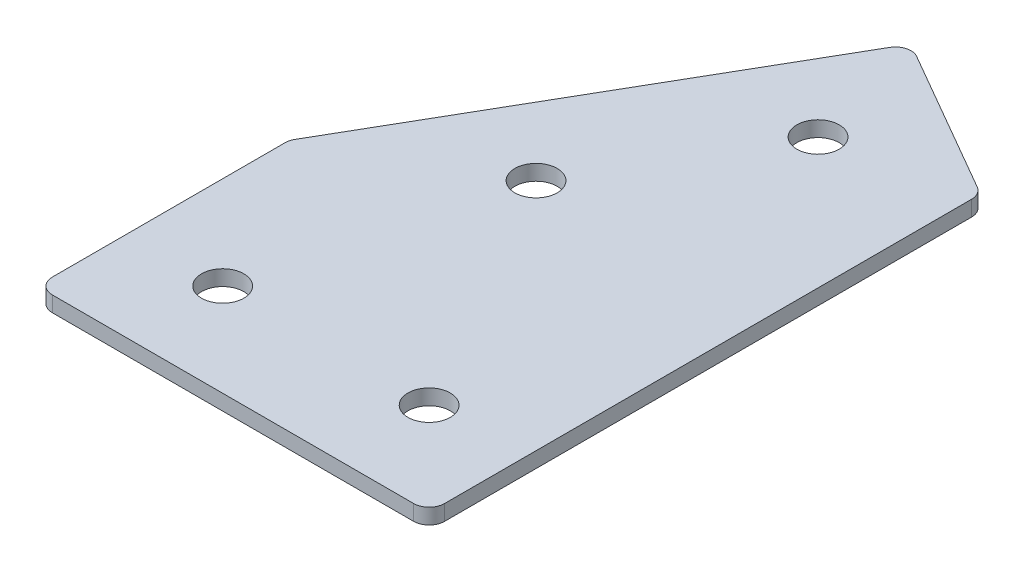
ISO-10303-21;
HEADER;
FILE_DESCRIPTION(('STEP AP214'),'2;1');
FILE_NAME('part.step','',(''),(''),'','','');
FILE_SCHEMA(('AUTOMOTIVE_DESIGN { 1 0 10303 214 1 1 1 1 }'));
ENDSEC;
DATA;
#1=APPLICATION_CONTEXT('core data for automotive mechanical design processes');
#2=APPLICATION_PROTOCOL_DEFINITION('international standard','automotive_design',2000,#1);
#3=PRODUCT_CONTEXT('',#1,'mechanical');
#4=PRODUCT('Part','Part','',(#3));
#5=PRODUCT_RELATED_PRODUCT_CATEGORY('part','',(#4));
#6=PRODUCT_DEFINITION_FORMATION('','',#4);
#7=PRODUCT_DEFINITION_CONTEXT('part definition',#1,'design');
#8=PRODUCT_DEFINITION('design','',#6,#7);
#9=PRODUCT_DEFINITION_SHAPE('','',#8);
#10=(LENGTH_UNIT() NAMED_UNIT(*) SI_UNIT(.MILLI.,.METRE.));
#11=(NAMED_UNIT(*) PLANE_ANGLE_UNIT() SI_UNIT($,.RADIAN.));
#12=(NAMED_UNIT(*) SI_UNIT($,.STERADIAN.) SOLID_ANGLE_UNIT());
#13=UNCERTAINTY_MEASURE_WITH_UNIT(LENGTH_MEASURE(1.E-05),#10,'distance_accuracy_value','');
#14=(GEOMETRIC_REPRESENTATION_CONTEXT(3) GLOBAL_UNCERTAINTY_ASSIGNED_CONTEXT((#13)) GLOBAL_UNIT_ASSIGNED_CONTEXT((#10,
#11,#12)) REPRESENTATION_CONTEXT('',''));
#15=CARTESIAN_POINT('',(0.,0.,0.));
#16=DIRECTION('',(0.,0.,1.));
#17=DIRECTION('',(1.,0.,0.));
#18=AXIS2_PLACEMENT_3D('',#15,#16,#17);
#19=CARTESIAN_POINT('',(0.,0.,0.));
#20=DIRECTION('',(0.,1.,0.));
#21=DIRECTION('',(0.,0.,1.));
#22=AXIS2_PLACEMENT_3D('',#19,#20,#21);
#23=PLANE('',#22);
#24=CARTESIAN_POINT('',(80.,0.,0.));
#25=DIRECTION('',(0.,1.,0.));
#26=DIRECTION('',(0.,0.,1.));
#27=AXIS2_PLACEMENT_3D('',#24,#25,#26);
#28=CIRCLE('',#27,4.09999999999999);
#29=CARTESIAN_POINT('',(80.,0.,4.09999999999999));
#30=VERTEX_POINT('',#29);
#31=EDGE_CURVE('E201',#30,#30,#28,.T.);
#32=ORIENTED_EDGE('',*,*,#31,.T.);
#33=EDGE_LOOP('',(#32));
#34=FACE_BOUND('',#33,.T.);
#35=CARTESIAN_POINT('',(72.6794919243111,0.,-82.6794919243113));
#36=DIRECTION('',(0.,1.,0.));
#37=DIRECTION('',(0.,0.,1.));
#38=AXIS2_PLACEMENT_3D('',#35,#36,#37);
#39=CIRCLE('',#38,4.09999999999997);
#40=CARTESIAN_POINT('',(72.6794919243111,0.,-78.5794919243114));
#41=VERTEX_POINT('',#40);
#42=EDGE_CURVE('E195',#41,#41,#39,.T.);
#43=ORIENTED_EDGE('',*,*,#42,.T.);
#44=EDGE_LOOP('',(#43));
#45=FACE_BOUND('',#44,.T.);
#46=CARTESIAN_POINT('',(52.6794919243111,0.,-48.0384757729338));
#47=DIRECTION('',(0.,1.,0.));
#48=DIRECTION('',(0.,0.,1.));
#49=AXIS2_PLACEMENT_3D('',#46,#47,#48);
#50=CIRCLE('',#49,4.1);
#51=CARTESIAN_POINT('',(52.6794919243111,0.,-43.9384757729338));
#52=VERTEX_POINT('',#51);
#53=EDGE_CURVE('E189',#52,#52,#50,.T.);
#54=ORIENTED_EDGE('',*,*,#53,.T.);
#55=EDGE_LOOP('',(#54));
#56=FACE_BOUND('',#55,.T.);
#57=CARTESIAN_POINT('',(40.,0.,0.));
#58=DIRECTION('',(0.,1.,0.));
#59=DIRECTION('',(0.,0.,1.));
#60=AXIS2_PLACEMENT_3D('',#57,#58,#59);
#61=CIRCLE('',#60,4.1);
#62=CARTESIAN_POINT('',(40.,0.,4.10000000000001));
#63=VERTEX_POINT('',#62);
#64=EDGE_CURVE('E115',#63,#63,#61,.T.);
#65=ORIENTED_EDGE('',*,*,#64,.T.);
#66=EDGE_LOOP('',(#65));
#67=FACE_BOUND('',#66,.T.);
#68=DIRECTION('',(0.,0.,1.));
#69=VECTOR('',#68,1.);
#70=CARTESIAN_POINT('',(22.,0.,-30.9000370096279));
#71=LINE('',#70,#69);
#72=CARTESIAN_POINT('',(22.,0.,-30.0961894323345));
#73=VERTEX_POINT('',#72);
#74=CARTESIAN_POINT('',(22.,0.,15.));
#75=VERTEX_POINT('',#74);
#76=EDGE_CURVE('E182',#73,#75,#71,.T.);
#77=ORIENTED_EDGE('',*,*,#76,.F.);
#78=CARTESIAN_POINT('',(25.,0.,-30.0961894323345));
#79=DIRECTION('',(0.,1.,0.));
#80=DIRECTION('',(0.,0.,1.));
#81=AXIS2_PLACEMENT_3D('',#78,#79,#80);
#82=CIRCLE('',#81,3.);
#83=CARTESIAN_POINT('',(22.4019237886466,0.,-31.5961894323345));
#84=VERTEX_POINT('',#83);
#85=EDGE_CURVE('E146',#73,#84,#82,.F.);
#86=ORIENTED_EDGE('',*,*,#85,.T.);
#87=DIRECTION('',(-0.5,0.,0.866025403784439));
#88=VECTOR('',#87,1.);
#89=CARTESIAN_POINT('',(66.0910346561912,0.,-107.267949192431));
#90=LINE('',#89,#88);
#91=CARTESIAN_POINT('',(64.5910346561912,0.,-104.669872981078));
#92=VERTEX_POINT('',#91);
#93=EDGE_CURVE('E174',#92,#84,#90,.T.);
#94=ORIENTED_EDGE('',*,*,#93,.F.);
#95=CARTESIAN_POINT('',(67.1891108675445,0.,-103.169872981078));
#96=DIRECTION('',(0.,1.,0.));
#97=DIRECTION('',(0.,0.,1.));
#98=AXIS2_PLACEMENT_3D('',#95,#96,#97);
#99=CIRCLE('',#98,3.);
#100=CARTESIAN_POINT('',(68.6891108675445,0.,-105.767949192431));
#101=VERTEX_POINT('',#100);
#102=EDGE_CURVE('E118',#92,#101,#99,.F.);
#103=ORIENTED_EDGE('',*,*,#102,.T.);
#104=DIRECTION('',(-0.866025403784439,0.,-0.499999999999999));
#105=VECTOR('',#104,1.);
#106=CARTESIAN_POINT('',(98.,0.,-88.8452994616208));
#107=LINE('',#106,#105);
#108=CARTESIAN_POINT('',(96.5,0.,-89.7113248654052));
#109=VERTEX_POINT('',#108);
#110=EDGE_CURVE('E119',#109,#101,#107,.T.);
#111=ORIENTED_EDGE('',*,*,#110,.F.);
#112=CARTESIAN_POINT('',(95.,0.,-87.1132486540519));
#113=DIRECTION('',(0.,1.,0.));
#114=DIRECTION('',(0.,0.,1.));
#115=AXIS2_PLACEMENT_3D('',#112,#113,#114);
#116=CIRCLE('',#115,3.);
#117=CARTESIAN_POINT('',(98.,0.,-87.1132486540519));
#118=VERTEX_POINT('',#117);
#119=EDGE_CURVE('E141',#109,#118,#116,.F.);
#120=ORIENTED_EDGE('',*,*,#119,.T.);
#121=DIRECTION('',(0.,0.,-1.));
#122=VECTOR('',#121,1.);
#123=CARTESIAN_POINT('',(98.,0.,18.));
#124=LINE('',#123,#122);
#125=CARTESIAN_POINT('',(98.,0.,15.));
#126=VERTEX_POINT('',#125);
#127=EDGE_CURVE('E123',#126,#118,#124,.T.);
#128=ORIENTED_EDGE('',*,*,#127,.F.);
#129=CARTESIAN_POINT('',(95.,0.,15.));
#130=DIRECTION('',(0.,1.,0.));
#131=DIRECTION('',(0.,0.,1.));
#132=AXIS2_PLACEMENT_3D('',#129,#130,#131);
#133=CIRCLE('',#132,3.);
#134=CARTESIAN_POINT('',(94.9999999999999,0.,18.));
#135=VERTEX_POINT('',#134);
#136=EDGE_CURVE('E31',#126,#135,#133,.F.);
#137=ORIENTED_EDGE('',*,*,#136,.T.);
#138=DIRECTION('',(1.,0.,0.));
#139=VECTOR('',#138,1.);
#140=CARTESIAN_POINT('',(22.,0.,18.));
#141=LINE('',#140,#139);
#142=CARTESIAN_POINT('',(25.,0.,18.));
#143=VERTEX_POINT('',#142);
#144=EDGE_CURVE('E180',#143,#135,#141,.T.);
#145=ORIENTED_EDGE('',*,*,#144,.F.);
#146=CARTESIAN_POINT('',(25.,0.,15.));
#147=DIRECTION('',(0.,1.,0.));
#148=DIRECTION('',(0.,0.,1.));
#149=AXIS2_PLACEMENT_3D('',#146,#147,#148);
#150=CIRCLE('',#149,3.);
#151=EDGE_CURVE('E144',#143,#75,#150,.F.);
#152=ORIENTED_EDGE('',*,*,#151,.T.);
#153=EDGE_LOOP('',(#77,#86,#94,#103,#111,#120,#128,#137,#145,#152));
#154=FACE_BOUND('',#153,.T.);
#155=ADVANCED_FACE('F16',(#34,#45,#56,#67,#154),#23,.F.);
#156=CARTESIAN_POINT('',(66.0910346561912,0.,-107.267949192431));
#157=DIRECTION('',(-0.866025403784439,0.,-0.5));
#158=DIRECTION('',(-0.5,0.,0.866025403784439));
#159=AXIS2_PLACEMENT_3D('',#156,#157,#158);
#160=PLANE('',#159);
#161=ORIENTED_EDGE('',*,*,#93,.T.);
#162=DIRECTION('',(0.,1.,0.));
#163=VECTOR('',#162,1.);
#164=CARTESIAN_POINT('',(22.4019237886466,0.,-31.5961894323345));
#165=LINE('',#164,#163);
#166=CARTESIAN_POINT('',(22.4019237886466,3.,-31.5961894323345));
#167=VERTEX_POINT('',#166);
#168=EDGE_CURVE('E105',#84,#167,#165,.T.);
#169=ORIENTED_EDGE('',*,*,#168,.T.);
#170=DIRECTION('',(-0.5,0.,0.866025403784439));
#171=VECTOR('',#170,1.);
#172=CARTESIAN_POINT('',(66.0910346561912,3.,-107.267949192431));
#173=LINE('',#172,#171);
#174=CARTESIAN_POINT('',(64.5910346561912,3.,-104.669872981078));
#175=VERTEX_POINT('',#174);
#176=EDGE_CURVE('E97',#175,#167,#173,.T.);
#177=ORIENTED_EDGE('',*,*,#176,.F.);
#178=DIRECTION('',(0.,1.,0.));
#179=VECTOR('',#178,1.);
#180=CARTESIAN_POINT('',(64.5910346561912,0.,-104.669872981078));
#181=LINE('',#180,#179);
#182=EDGE_CURVE('E111',#175,#92,#181,.F.);
#183=ORIENTED_EDGE('',*,*,#182,.T.);
#184=EDGE_LOOP('',(#161,#169,#177,#183));
#185=FACE_BOUND('',#184,.T.);
#186=ADVANCED_FACE('F110',(#185),#160,.T.);
#187=CARTESIAN_POINT('',(98.,0.,-88.8452994616208));
#188=DIRECTION('',(0.499999999999999,0.,-0.866025403784439));
#189=DIRECTION('',(-0.866025403784439,0.,-0.499999999999999));
#190=AXIS2_PLACEMENT_3D('',#187,#188,#189);
#191=PLANE('',#190);
#192=DIRECTION('',(-0.866025403784439,0.,-0.499999999999999));
#193=VECTOR('',#192,1.);
#194=CARTESIAN_POINT('',(98.,3.,-88.8452994616208));
#195=LINE('',#194,#193);
#196=CARTESIAN_POINT('',(96.5,3.,-89.7113248654052));
#197=VERTEX_POINT('',#196);
#198=CARTESIAN_POINT('',(68.6891108675445,3.,-105.767949192431));
#199=VERTEX_POINT('',#198);
#200=EDGE_CURVE('E99',#197,#199,#195,.T.);
#201=ORIENTED_EDGE('',*,*,#200,.F.);
#202=DIRECTION('',(0.,1.,0.));
#203=VECTOR('',#202,1.);
#204=CARTESIAN_POINT('',(96.5,0.,-89.7113248654052));
#205=LINE('',#204,#203);
#206=EDGE_CURVE('E10',#197,#109,#205,.F.);
#207=ORIENTED_EDGE('',*,*,#206,.T.);
#208=ORIENTED_EDGE('',*,*,#110,.T.);
#209=DIRECTION('',(0.,1.,0.));
#210=VECTOR('',#209,1.);
#211=CARTESIAN_POINT('',(68.6891108675445,0.,-105.767949192431));
#212=LINE('',#211,#210);
#213=EDGE_CURVE('E24',#101,#199,#212,.T.);
#214=ORIENTED_EDGE('',*,*,#213,.T.);
#215=EDGE_LOOP('',(#201,#207,#208,#214));
#216=FACE_BOUND('',#215,.T.);
#217=ADVANCED_FACE('F157',(#216),#191,.T.);
#218=CARTESIAN_POINT('',(98.,0.,18.));
#219=DIRECTION('',(1.,0.,0.));
#220=DIRECTION('',(0.,0.,-1.));
#221=AXIS2_PLACEMENT_3D('',#218,#219,#220);
#222=PLANE('',#221);
#223=DIRECTION('',(0.,0.,-1.));
#224=VECTOR('',#223,1.);
#225=CARTESIAN_POINT('',(98.,3.,18.));
#226=LINE('',#225,#224);
#227=CARTESIAN_POINT('',(98.,3.,15.));
#228=VERTEX_POINT('',#227);
#229=CARTESIAN_POINT('',(98.,3.,-87.1132486540519));
#230=VERTEX_POINT('',#229);
#231=EDGE_CURVE('E170',#228,#230,#226,.T.);
#232=ORIENTED_EDGE('',*,*,#231,.F.);
#233=DIRECTION('',(0.,1.,0.));
#234=VECTOR('',#233,1.);
#235=CARTESIAN_POINT('',(98.,0.,15.));
#236=LINE('',#235,#234);
#237=EDGE_CURVE('E155',#228,#126,#236,.F.);
#238=ORIENTED_EDGE('',*,*,#237,.T.);
#239=ORIENTED_EDGE('',*,*,#127,.T.);
#240=DIRECTION('',(0.,1.,0.));
#241=VECTOR('',#240,1.);
#242=CARTESIAN_POINT('',(98.,0.,-87.1132486540519));
#243=LINE('',#242,#241);
#244=EDGE_CURVE('E152',#118,#230,#243,.T.);
#245=ORIENTED_EDGE('',*,*,#244,.T.);
#246=EDGE_LOOP('',(#232,#238,#239,#245));
#247=FACE_BOUND('',#246,.T.);
#248=ADVANCED_FACE('F169',(#247),#222,.T.);
#249=CARTESIAN_POINT('',(22.,0.,18.));
#250=DIRECTION('',(0.,0.,1.));
#251=DIRECTION('',(1.,0.,0.));
#252=AXIS2_PLACEMENT_3D('',#249,#250,#251);
#253=PLANE('',#252);
#254=DIRECTION('',(1.,0.,0.));
#255=VECTOR('',#254,1.);
#256=CARTESIAN_POINT('',(22.,3.,18.));
#257=LINE('',#256,#255);
#258=CARTESIAN_POINT('',(25.,3.,18.));
#259=VERTEX_POINT('',#258);
#260=CARTESIAN_POINT('',(94.9999999999999,3.,18.));
#261=VERTEX_POINT('',#260);
#262=EDGE_CURVE('E173',#259,#261,#257,.T.);
#263=ORIENTED_EDGE('',*,*,#262,.F.);
#264=DIRECTION('',(0.,1.,0.));
#265=VECTOR('',#264,1.);
#266=CARTESIAN_POINT('',(25.,0.,18.));
#267=LINE('',#266,#265);
#268=EDGE_CURVE('E38',#259,#143,#267,.F.);
#269=ORIENTED_EDGE('',*,*,#268,.T.);
#270=ORIENTED_EDGE('',*,*,#144,.T.);
#271=DIRECTION('',(0.,1.,0.));
#272=VECTOR('',#271,1.);
#273=CARTESIAN_POINT('',(95.,0.,18.));
#274=LINE('',#273,#272);
#275=EDGE_CURVE('E148',#135,#261,#274,.T.);
#276=ORIENTED_EDGE('',*,*,#275,.T.);
#277=EDGE_LOOP('',(#263,#269,#270,#276));
#278=FACE_BOUND('',#277,.T.);
#279=ADVANCED_FACE('F337',(#278),#253,.T.);
#280=CARTESIAN_POINT('',(22.,0.,-30.9000370096279));
#281=DIRECTION('',(-1.,0.,0.));
#282=DIRECTION('',(0.,0.,1.));
#283=AXIS2_PLACEMENT_3D('',#280,#281,#282);
#284=PLANE('',#283);
#285=DIRECTION('',(0.,0.,1.));
#286=VECTOR('',#285,1.);
#287=CARTESIAN_POINT('',(22.,3.,-30.9000370096279));
#288=LINE('',#287,#286);
#289=CARTESIAN_POINT('',(22.,3.,-30.0961894323345));
#290=VERTEX_POINT('',#289);
#291=CARTESIAN_POINT('',(22.,3.,15.));
#292=VERTEX_POINT('',#291);
#293=EDGE_CURVE('E114',#290,#292,#288,.T.);
#294=ORIENTED_EDGE('',*,*,#293,.F.);
#295=DIRECTION('',(0.,1.,0.));
#296=VECTOR('',#295,1.);
#297=CARTESIAN_POINT('',(22.,0.,-30.0961894323345));
#298=LINE('',#297,#296);
#299=EDGE_CURVE('E138',#290,#73,#298,.F.);
#300=ORIENTED_EDGE('',*,*,#299,.T.);
#301=ORIENTED_EDGE('',*,*,#76,.T.);
#302=DIRECTION('',(0.,1.,0.));
#303=VECTOR('',#302,1.);
#304=CARTESIAN_POINT('',(22.,0.,15.));
#305=LINE('',#304,#303);
#306=EDGE_CURVE('E135',#75,#292,#305,.T.);
#307=ORIENTED_EDGE('',*,*,#306,.T.);
#308=EDGE_LOOP('',(#294,#300,#301,#307));
#309=FACE_BOUND('',#308,.T.);
#310=ADVANCED_FACE('F223',(#309),#284,.T.);
#311=CARTESIAN_POINT('',(0.,3.,0.));
#312=DIRECTION('',(0.,1.,0.));
#313=DIRECTION('',(0.,0.,1.));
#314=AXIS2_PLACEMENT_3D('',#311,#312,#313);
#315=PLANE('',#314);
#316=CARTESIAN_POINT('',(80.,3.,0.));
#317=DIRECTION('',(0.,1.,0.));
#318=DIRECTION('',(0.,0.,1.));
#319=AXIS2_PLACEMENT_3D('',#316,#317,#318);
#320=CIRCLE('',#319,4.09999999999999);
#321=CARTESIAN_POINT('',(80.,3.,4.09999999999999));
#322=VERTEX_POINT('',#321);
#323=EDGE_CURVE('E204',#322,#322,#320,.T.);
#324=ORIENTED_EDGE('',*,*,#323,.F.);
#325=EDGE_LOOP('',(#324));
#326=FACE_BOUND('',#325,.T.);
#327=CARTESIAN_POINT('',(72.6794919243111,3.,-82.6794919243113));
#328=DIRECTION('',(0.,1.,0.));
#329=DIRECTION('',(0.,0.,1.));
#330=AXIS2_PLACEMENT_3D('',#327,#328,#329);
#331=CIRCLE('',#330,4.09999999999997);
#332=CARTESIAN_POINT('',(72.6794919243111,3.,-78.5794919243114));
#333=VERTEX_POINT('',#332);
#334=EDGE_CURVE('E198',#333,#333,#331,.T.);
#335=ORIENTED_EDGE('',*,*,#334,.F.);
#336=EDGE_LOOP('',(#335));
#337=FACE_BOUND('',#336,.T.);
#338=CARTESIAN_POINT('',(52.6794919243111,3.,-48.0384757729338));
#339=DIRECTION('',(0.,1.,0.));
#340=DIRECTION('',(0.,0.,1.));
#341=AXIS2_PLACEMENT_3D('',#338,#339,#340);
#342=CIRCLE('',#341,4.1);
#343=CARTESIAN_POINT('',(52.6794919243111,3.,-43.9384757729338));
#344=VERTEX_POINT('',#343);
#345=EDGE_CURVE('E192',#344,#344,#342,.T.);
#346=ORIENTED_EDGE('',*,*,#345,.F.);
#347=EDGE_LOOP('',(#346));
#348=FACE_BOUND('',#347,.T.);
#349=CARTESIAN_POINT('',(40.,3.,0.));
#350=DIRECTION('',(0.,1.,0.));
#351=DIRECTION('',(0.,0.,1.));
#352=AXIS2_PLACEMENT_3D('',#349,#350,#351);
#353=CIRCLE('',#352,4.1);
#354=CARTESIAN_POINT('',(40.,3.,4.10000000000001));
#355=VERTEX_POINT('',#354);
#356=EDGE_CURVE('E186',#355,#355,#353,.T.);
#357=ORIENTED_EDGE('',*,*,#356,.F.);
#358=EDGE_LOOP('',(#357));
#359=FACE_BOUND('',#358,.T.);
#360=ORIENTED_EDGE('',*,*,#176,.T.);
#361=CARTESIAN_POINT('',(25.,3.,-30.0961894323345));
#362=DIRECTION('',(0.,1.,0.));
#363=DIRECTION('',(0.,0.,1.));
#364=AXIS2_PLACEMENT_3D('',#361,#362,#363);
#365=CIRCLE('',#364,3.);
#366=EDGE_CURVE('E133',#167,#290,#365,.T.);
#367=ORIENTED_EDGE('',*,*,#366,.T.);
#368=ORIENTED_EDGE('',*,*,#293,.T.);
#369=CARTESIAN_POINT('',(25.,3.,15.));
#370=DIRECTION('',(0.,1.,0.));
#371=DIRECTION('',(0.,0.,1.));
#372=AXIS2_PLACEMENT_3D('',#369,#370,#371);
#373=CIRCLE('',#372,3.);
#374=EDGE_CURVE('E131',#292,#259,#373,.T.);
#375=ORIENTED_EDGE('',*,*,#374,.T.);
#376=ORIENTED_EDGE('',*,*,#262,.T.);
#377=CARTESIAN_POINT('',(95.,3.,15.));
#378=DIRECTION('',(0.,1.,0.));
#379=DIRECTION('',(0.,0.,1.));
#380=AXIS2_PLACEMENT_3D('',#377,#378,#379);
#381=CIRCLE('',#380,3.);
#382=EDGE_CURVE('E129',#261,#228,#381,.T.);
#383=ORIENTED_EDGE('',*,*,#382,.T.);
#384=ORIENTED_EDGE('',*,*,#231,.T.);
#385=CARTESIAN_POINT('',(95.,3.,-87.1132486540519));
#386=DIRECTION('',(0.,1.,0.));
#387=DIRECTION('',(0.,0.,1.));
#388=AXIS2_PLACEMENT_3D('',#385,#386,#387);
#389=CIRCLE('',#388,3.);
#390=EDGE_CURVE('E104',#230,#197,#389,.T.);
#391=ORIENTED_EDGE('',*,*,#390,.T.);
#392=ORIENTED_EDGE('',*,*,#200,.T.);
#393=CARTESIAN_POINT('',(67.1891108675445,3.,-103.169872981078));
#394=DIRECTION('',(0.,1.,0.));
#395=DIRECTION('',(0.,0.,1.));
#396=AXIS2_PLACEMENT_3D('',#393,#394,#395);
#397=CIRCLE('',#396,3.);
#398=EDGE_CURVE('E94',#199,#175,#397,.T.);
#399=ORIENTED_EDGE('',*,*,#398,.T.);
#400=EDGE_LOOP('',(#360,#367,#368,#375,#376,#383,#384,#391,#392,#399));
#401=FACE_BOUND('',#400,.T.);
#402=ADVANCED_FACE('F96',(#326,#337,#348,#359,#401),#315,.T.);
#403=CARTESIAN_POINT('',(40.,0.,0.));
#404=DIRECTION('',(0.,1.,0.));
#405=DIRECTION('',(0.,0.,1.));
#406=AXIS2_PLACEMENT_3D('',#403,#404,#405);
#407=CYLINDRICAL_SURFACE('',#406,4.1);
#408=ORIENTED_EDGE('',*,*,#64,.F.);
#409=EDGE_LOOP('',(#408));
#410=FACE_BOUND('',#409,.T.);
#411=ORIENTED_EDGE('',*,*,#356,.T.);
#412=EDGE_LOOP('',(#411));
#413=FACE_BOUND('',#412,.T.);
#414=ADVANCED_FACE('F222',(#410,#413),#407,.F.);
#415=CARTESIAN_POINT('',(52.6794919243111,0.,-48.0384757729338));
#416=DIRECTION('',(0.,1.,0.));
#417=DIRECTION('',(0.,0.,1.));
#418=AXIS2_PLACEMENT_3D('',#415,#416,#417);
#419=CYLINDRICAL_SURFACE('',#418,4.1);
#420=ORIENTED_EDGE('',*,*,#53,.F.);
#421=EDGE_LOOP('',(#420));
#422=FACE_BOUND('',#421,.T.);
#423=ORIENTED_EDGE('',*,*,#345,.T.);
#424=EDGE_LOOP('',(#423));
#425=FACE_BOUND('',#424,.T.);
#426=ADVANCED_FACE('F232',(#422,#425),#419,.F.);
#427=CARTESIAN_POINT('',(72.6794919243111,0.,-82.6794919243113));
#428=DIRECTION('',(0.,1.,0.));
#429=DIRECTION('',(0.,0.,1.));
#430=AXIS2_PLACEMENT_3D('',#427,#428,#429);
#431=CYLINDRICAL_SURFACE('',#430,4.09999999999997);
#432=ORIENTED_EDGE('',*,*,#42,.F.);
#433=EDGE_LOOP('',(#432));
#434=FACE_BOUND('',#433,.T.);
#435=ORIENTED_EDGE('',*,*,#334,.T.);
#436=EDGE_LOOP('',(#435));
#437=FACE_BOUND('',#436,.T.);
#438=ADVANCED_FACE('F216',(#434,#437),#431,.F.);
#439=CARTESIAN_POINT('',(80.,0.,0.));
#440=DIRECTION('',(0.,1.,0.));
#441=DIRECTION('',(0.,0.,1.));
#442=AXIS2_PLACEMENT_3D('',#439,#440,#441);
#443=CYLINDRICAL_SURFACE('',#442,4.09999999999999);
#444=ORIENTED_EDGE('',*,*,#31,.F.);
#445=EDGE_LOOP('',(#444));
#446=FACE_BOUND('',#445,.T.);
#447=ORIENTED_EDGE('',*,*,#323,.T.);
#448=EDGE_LOOP('',(#447));
#449=FACE_BOUND('',#448,.T.);
#450=ADVANCED_FACE('F212',(#446,#449),#443,.F.);
#451=CARTESIAN_POINT('',(25.,0.,-30.0961894323345));
#452=DIRECTION('',(0.,1.,0.));
#453=DIRECTION('',(0.,0.,1.));
#454=AXIS2_PLACEMENT_3D('',#451,#452,#453);
#455=CYLINDRICAL_SURFACE('',#454,3.);
#456=ORIENTED_EDGE('',*,*,#85,.F.);
#457=ORIENTED_EDGE('',*,*,#299,.F.);
#458=ORIENTED_EDGE('',*,*,#366,.F.);
#459=ORIENTED_EDGE('',*,*,#168,.F.);
#460=EDGE_LOOP('',(#456,#457,#458,#459));
#461=FACE_BOUND('',#460,.T.);
#462=ADVANCED_FACE('F215',(#461),#455,.T.);
#463=CARTESIAN_POINT('',(25.,0.,15.));
#464=DIRECTION('',(0.,1.,0.));
#465=DIRECTION('',(0.,0.,1.));
#466=AXIS2_PLACEMENT_3D('',#463,#464,#465);
#467=CYLINDRICAL_SURFACE('',#466,3.);
#468=ORIENTED_EDGE('',*,*,#151,.F.);
#469=ORIENTED_EDGE('',*,*,#268,.F.);
#470=ORIENTED_EDGE('',*,*,#374,.F.);
#471=ORIENTED_EDGE('',*,*,#306,.F.);
#472=EDGE_LOOP('',(#468,#469,#470,#471));
#473=FACE_BOUND('',#472,.T.);
#474=ADVANCED_FACE('F252',(#473),#467,.T.);
#475=CARTESIAN_POINT('',(95.,0.,15.));
#476=DIRECTION('',(0.,1.,0.));
#477=DIRECTION('',(0.,0.,1.));
#478=AXIS2_PLACEMENT_3D('',#475,#476,#477);
#479=CYLINDRICAL_SURFACE('',#478,3.);
#480=ORIENTED_EDGE('',*,*,#136,.F.);
#481=ORIENTED_EDGE('',*,*,#237,.F.);
#482=ORIENTED_EDGE('',*,*,#382,.F.);
#483=ORIENTED_EDGE('',*,*,#275,.F.);
#484=EDGE_LOOP('',(#480,#481,#482,#483));
#485=FACE_BOUND('',#484,.T.);
#486=ADVANCED_FACE('F256',(#485),#479,.T.);
#487=CARTESIAN_POINT('',(95.,0.,-87.1132486540519));
#488=DIRECTION('',(0.,1.,0.));
#489=DIRECTION('',(0.,0.,1.));
#490=AXIS2_PLACEMENT_3D('',#487,#488,#489);
#491=CYLINDRICAL_SURFACE('',#490,3.);
#492=ORIENTED_EDGE('',*,*,#119,.F.);
#493=ORIENTED_EDGE('',*,*,#206,.F.);
#494=ORIENTED_EDGE('',*,*,#390,.F.);
#495=ORIENTED_EDGE('',*,*,#244,.F.);
#496=EDGE_LOOP('',(#492,#493,#494,#495));
#497=FACE_BOUND('',#496,.T.);
#498=ADVANCED_FACE('F165',(#497),#491,.T.);
#499=CARTESIAN_POINT('',(67.1891108675445,0.,-103.169872981078));
#500=DIRECTION('',(0.,1.,0.));
#501=DIRECTION('',(0.,0.,1.));
#502=AXIS2_PLACEMENT_3D('',#499,#500,#501);
#503=CYLINDRICAL_SURFACE('',#502,3.);
#504=ORIENTED_EDGE('',*,*,#102,.F.);
#505=ORIENTED_EDGE('',*,*,#182,.F.);
#506=ORIENTED_EDGE('',*,*,#398,.F.);
#507=ORIENTED_EDGE('',*,*,#213,.F.);
#508=EDGE_LOOP('',(#504,#505,#506,#507));
#509=FACE_BOUND('',#508,.T.);
#510=ADVANCED_FACE('F18',(#509),#503,.T.);
#511=CLOSED_SHELL('',(#155,#186,#217,#248,#279,#310,#402,#414,#426,#438,#450,#462,#474,#486,
#498,#510));
#512=MANIFOLD_SOLID_BREP('B1',#511);
#513=ADVANCED_BREP_SHAPE_REPRESENTATION('',(#18,#512),#14);
#514=SHAPE_DEFINITION_REPRESENTATION(#9,#513);
ENDSEC;
END-ISO-10303-21;
